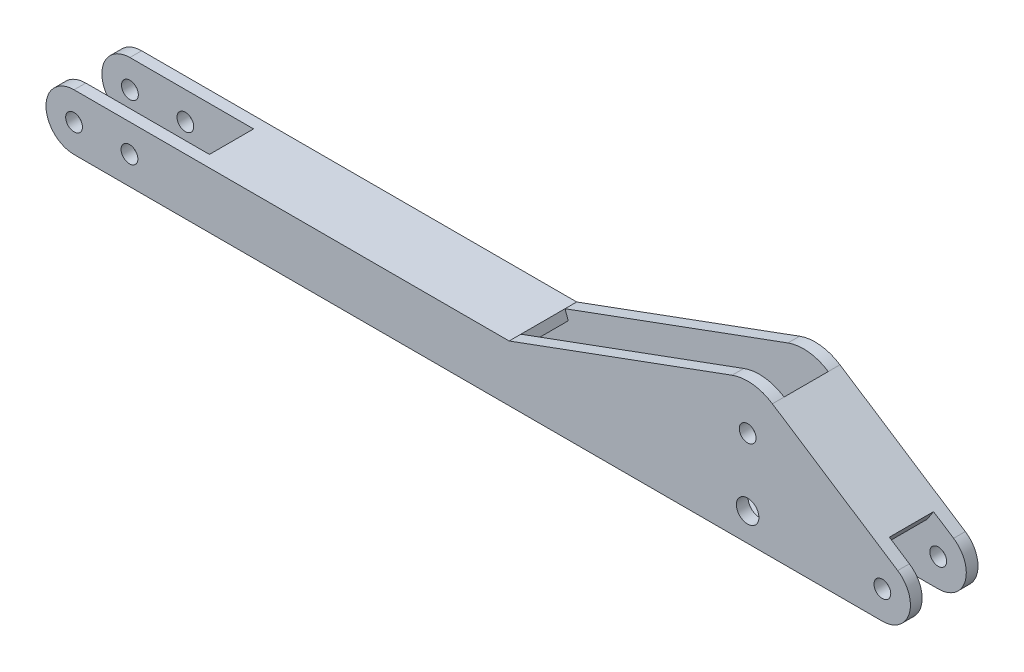
ISO-10303-21;
HEADER;
FILE_DESCRIPTION(('STEP AP214'),'2;1');
FILE_NAME('part.step','',(''),(''),'','','');
FILE_SCHEMA(('AUTOMOTIVE_DESIGN { 1 0 10303 214 1 1 1 1 }'));
ENDSEC;
DATA;
#1=APPLICATION_CONTEXT('core data for automotive mechanical design processes');
#2=APPLICATION_PROTOCOL_DEFINITION('international standard','automotive_design',2000,#1);
#3=PRODUCT_CONTEXT('',#1,'mechanical');
#4=PRODUCT('Part','Part','',(#3));
#5=PRODUCT_RELATED_PRODUCT_CATEGORY('part','',(#4));
#6=PRODUCT_DEFINITION_FORMATION('','',#4);
#7=PRODUCT_DEFINITION_CONTEXT('part definition',#1,'design');
#8=PRODUCT_DEFINITION('design','',#6,#7);
#9=PRODUCT_DEFINITION_SHAPE('','',#8);
#10=(LENGTH_UNIT() NAMED_UNIT(*) SI_UNIT(.MILLI.,.METRE.));
#11=(NAMED_UNIT(*) PLANE_ANGLE_UNIT() SI_UNIT($,.RADIAN.));
#12=(NAMED_UNIT(*) SI_UNIT($,.STERADIAN.) SOLID_ANGLE_UNIT());
#13=UNCERTAINTY_MEASURE_WITH_UNIT(LENGTH_MEASURE(1.E-05),#10,'distance_accuracy_value','');
#14=(GEOMETRIC_REPRESENTATION_CONTEXT(3) GLOBAL_UNCERTAINTY_ASSIGNED_CONTEXT((#13)) GLOBAL_UNIT_ASSIGNED_CONTEXT((#10,
#11,#12)) REPRESENTATION_CONTEXT('',''));
#15=CARTESIAN_POINT('',(0.,0.,0.));
#16=DIRECTION('',(0.,0.,1.));
#17=DIRECTION('',(1.,0.,0.));
#18=AXIS2_PLACEMENT_3D('',#15,#16,#17);
#19=CARTESIAN_POINT('',(3737.25460998602,-1090.59887645525,253.));
#20=DIRECTION('',(0.938772230359125,0.344538386114745,0.));
#21=DIRECTION('',(-0.344538386114745,0.938772230359126,0.));
#22=AXIS2_PLACEMENT_3D('',#19,#20,#21);
#23=PLANE('',#22);
#24=DIRECTION('',(-0.344538386114745,0.938772230359125,0.));
#25=VECTOR('',#24,1.);
#26=CARTESIAN_POINT('',(3737.25460998602,-1090.59887645525,253.));
#27=LINE('',#26,#25);
#28=CARTESIAN_POINT('',(3368.92422481028,-86.9999999999998,253.));
#29=VERTEX_POINT('',#28);
#30=CARTESIAN_POINT('',(3363.41747708127,-71.9956287719269,253.));
#31=VERTEX_POINT('',#30);
#32=EDGE_CURVE('E378',#29,#31,#27,.T.);
#33=ORIENTED_EDGE('',*,*,#32,.T.);
#34=DIRECTION('',(0.,0.,-1.));
#35=VECTOR('',#34,1.);
#36=CARTESIAN_POINT('',(3363.41747708127,-71.9956287719263,253.));
#37=LINE('',#36,#35);
#38=CARTESIAN_POINT('',(3363.41747708127,-71.9956287719261,53.));
#39=VERTEX_POINT('',#38);
#40=EDGE_CURVE('E11',#31,#39,#37,.T.);
#41=ORIENTED_EDGE('',*,*,#40,.T.);
#42=DIRECTION('',(-0.344538386114745,0.938772230359125,0.));
#43=VECTOR('',#42,1.);
#44=CARTESIAN_POINT('',(3737.25460998602,-1090.59887645525,53.));
#45=LINE('',#44,#43);
#46=CARTESIAN_POINT('',(3368.92422481028,-86.9999999999997,53.));
#47=VERTEX_POINT('',#46);
#48=EDGE_CURVE('E385',#47,#39,#45,.T.);
#49=ORIENTED_EDGE('',*,*,#48,.F.);
#50=DIRECTION('',(0.,0.,1.));
#51=VECTOR('',#50,1.);
#52=CARTESIAN_POINT('',(3368.92422481028,-86.9999999999997,253.));
#53=LINE('',#52,#51);
#54=EDGE_CURVE('E392',#47,#29,#53,.T.);
#55=ORIENTED_EDGE('',*,*,#54,.T.);
#56=EDGE_LOOP('',(#33,#41,#49,#55));
#57=FACE_BOUND('',#56,.T.);
#58=ADVANCED_FACE('F33',(#57),#23,.F.);
#59=CARTESIAN_POINT('',(3050.,305.,306.));
#60=DIRECTION('',(0.,0.,-1.));
#61=DIRECTION('',(-1.,0.,0.));
#62=AXIS2_PLACEMENT_3D('',#59,#60,#61);
#63=CYLINDRICAL_SURFACE('',#62,205.);
#64=DIRECTION('',(0.,0.,-1.));
#65=VECTOR('',#64,1.);
#66=CARTESIAN_POINT('',(2979.36963084648,497.448307223621,306.));
#67=LINE('',#66,#65);
#68=CARTESIAN_POINT('',(2979.36963084648,497.448307223621,53.));
#69=VERTEX_POINT('',#68);
#70=CARTESIAN_POINT('',(2979.36963084648,497.448307223621,0.));
#71=VERTEX_POINT('',#70);
#72=EDGE_CURVE('E350',#69,#71,#67,.T.);
#73=ORIENTED_EDGE('',*,*,#72,.F.);
#74=CARTESIAN_POINT('',(3050.,305.,53.));
#75=DIRECTION('',(0.,0.,-1.));
#76=DIRECTION('',(-1.,0.,0.));
#77=AXIS2_PLACEMENT_3D('',#74,#75,#76);
#78=CIRCLE('',#77,205.);
#79=CARTESIAN_POINT('',(3162.04770969218,476.669189876161,53.));
#80=VERTEX_POINT('',#79);
#81=EDGE_CURVE('E399',#69,#80,#78,.T.);
#82=ORIENTED_EDGE('',*,*,#81,.T.);
#83=DIRECTION('',(0.,0.,-1.));
#84=VECTOR('',#83,1.);
#85=CARTESIAN_POINT('',(3162.04770969218,476.669189876161,306.));
#86=LINE('',#85,#84);
#87=CARTESIAN_POINT('',(3162.04770969218,476.669189876161,0.));
#88=VERTEX_POINT('',#87);
#89=EDGE_CURVE('E309',#80,#88,#86,.T.);
#90=ORIENTED_EDGE('',*,*,#89,.T.);
#91=CARTESIAN_POINT('',(3050.,305.,0.));
#92=DIRECTION('',(0.,0.,1.));
#93=DIRECTION('',(1.,0.,0.));
#94=AXIS2_PLACEMENT_3D('',#91,#92,#93);
#95=CIRCLE('',#94,205.);
#96=EDGE_CURVE('E290',#88,#71,#95,.T.);
#97=ORIENTED_EDGE('',*,*,#96,.T.);
#98=EDGE_LOOP('',(#73,#82,#90,#97));
#99=FACE_BOUND('',#98,.T.);
#100=ADVANCED_FACE('F440',(#99),#63,.T.);
#101=CARTESIAN_POINT('',(1970.,127.,306.));
#102=DIRECTION('',(0.344538386114745,-0.938772230359125,0.));
#103=DIRECTION('',(0.938772230359126,0.344538386114745,0.));
#104=AXIS2_PLACEMENT_3D('',#101,#102,#103);
#105=PLANE('',#104);
#106=DIRECTION('',(0.,0.,-1.));
#107=VECTOR('',#106,1.);
#108=CARTESIAN_POINT('',(1970.,127.,306.));
#109=LINE('',#108,#107);
#110=CARTESIAN_POINT('',(1970.,127.,53.));
#111=VERTEX_POINT('',#110);
#112=CARTESIAN_POINT('',(1970.,127.,0.));
#113=VERTEX_POINT('',#112);
#114=EDGE_CURVE('E346',#111,#113,#109,.T.);
#115=ORIENTED_EDGE('',*,*,#114,.F.);
#116=DIRECTION('',(-0.938772230359125,-0.344538386114745,0.));
#117=VECTOR('',#116,1.);
#118=CARTESIAN_POINT('',(1970.,127.,53.));
#119=LINE('',#118,#117);
#120=EDGE_CURVE('E382',#69,#111,#119,.T.);
#121=ORIENTED_EDGE('',*,*,#120,.F.);
#122=ORIENTED_EDGE('',*,*,#72,.T.);
#123=DIRECTION('',(-0.938772230359125,-0.344538386114745,0.));
#124=VECTOR('',#123,1.);
#125=CARTESIAN_POINT('',(1970.,127.,0.));
#126=LINE('',#125,#124);
#127=EDGE_CURVE('E312',#71,#113,#126,.T.);
#128=ORIENTED_EDGE('',*,*,#127,.T.);
#129=EDGE_LOOP('',(#115,#121,#122,#128));
#130=FACE_BOUND('',#129,.T.);
#131=ADVANCED_FACE('F515',(#130),#105,.F.);
#132=CARTESIAN_POINT('',(3050.,305.,306.));
#133=DIRECTION('',(0.,0.,-1.));
#134=DIRECTION('',(-1.,0.,0.));
#135=AXIS2_PLACEMENT_3D('',#132,#133,#134);
#136=CYLINDRICAL_SURFACE('',#135,38.0000000000003);
#137=CARTESIAN_POINT('',(3050.,305.,53.));
#138=DIRECTION('',(0.,0.,-1.));
#139=DIRECTION('',(-1.,0.,0.));
#140=AXIS2_PLACEMENT_3D('',#137,#138,#139);
#141=CIRCLE('',#140,38.0000000000003);
#142=CARTESIAN_POINT('',(3012.,305.,53.));
#143=VERTEX_POINT('',#142);
#144=EDGE_CURVE('E396',#143,#143,#141,.T.);
#145=ORIENTED_EDGE('',*,*,#144,.F.);
#146=EDGE_LOOP('',(#145));
#147=FACE_BOUND('',#146,.T.);
#148=CARTESIAN_POINT('',(3050.,305.,0.));
#149=DIRECTION('',(0.,0.,1.));
#150=DIRECTION('',(1.,0.,0.));
#151=AXIS2_PLACEMENT_3D('',#148,#149,#150);
#152=CIRCLE('',#151,38.0000000000003);
#153=CARTESIAN_POINT('',(3088.,305.,0.));
#154=VERTEX_POINT('',#153);
#155=EDGE_CURVE('E266',#154,#154,#152,.T.);
#156=ORIENTED_EDGE('',*,*,#155,.F.);
#157=EDGE_LOOP('',(#156));
#158=FACE_BOUND('',#157,.T.);
#159=ADVANCED_FACE('F528',(#147,#158),#136,.F.);
#160=CARTESIAN_POINT('',(3050.,0.,306.));
#161=DIRECTION('',(0.,0.,-1.));
#162=DIRECTION('',(-1.,0.,0.));
#163=AXIS2_PLACEMENT_3D('',#160,#161,#162);
#164=CYLINDRICAL_SURFACE('',#163,51.0000000000001);
#165=CARTESIAN_POINT('',(3050.,0.,253.));
#166=DIRECTION('',(0.,0.,1.));
#167=DIRECTION('',(1.,0.,0.));
#168=AXIS2_PLACEMENT_3D('',#165,#166,#167);
#169=CIRCLE('',#168,51.0000000000001);
#170=CARTESIAN_POINT('',(3101.,0.,253.));
#171=VERTEX_POINT('',#170);
#172=EDGE_CURVE('E414',#171,#171,#169,.T.);
#173=ORIENTED_EDGE('',*,*,#172,.F.);
#174=EDGE_LOOP('',(#173));
#175=FACE_BOUND('',#174,.T.);
#176=CARTESIAN_POINT('',(3050.,0.,306.));
#177=DIRECTION('',(0.,0.,1.));
#178=DIRECTION('',(1.,0.,0.));
#179=AXIS2_PLACEMENT_3D('',#176,#177,#178);
#180=CIRCLE('',#179,51.0000000000001);
#181=CARTESIAN_POINT('',(3101.,0.,306.));
#182=VERTEX_POINT('',#181);
#183=EDGE_CURVE('E275',#182,#182,#180,.T.);
#184=ORIENTED_EDGE('',*,*,#183,.T.);
#185=EDGE_LOOP('',(#184));
#186=FACE_BOUND('',#185,.T.);
#187=ADVANCED_FACE('F569',(#175,#186),#164,.F.);
#188=CARTESIAN_POINT('',(3660.,-127.,306.));
#189=DIRECTION('',(0.,1.,0.));
#190=DIRECTION('',(-1.,0.,0.));
#191=AXIS2_PLACEMENT_3D('',#188,#189,#190);
#192=PLANE('',#191);
#193=DIRECTION('',(1.,0.,0.));
#194=VECTOR('',#193,1.);
#195=CARTESIAN_POINT('',(3447.69011303529,-127.,53.));
#196=LINE('',#195,#194);
#197=CARTESIAN_POINT('',(3447.69011303529,-127.,53.));
#198=VERTEX_POINT('',#197);
#199=CARTESIAN_POINT('',(3660.,-127.,53.));
#200=VERTEX_POINT('',#199);
#201=EDGE_CURVE('E210',#198,#200,#196,.T.);
#202=ORIENTED_EDGE('',*,*,#201,.F.);
#203=DIRECTION('',(0.,0.,1.));
#204=VECTOR('',#203,1.);
#205=CARTESIAN_POINT('',(3447.69011303529,-127.,53.));
#206=LINE('',#205,#204);
#207=CARTESIAN_POINT('',(3447.69011303529,-127.,253.));
#208=VERTEX_POINT('',#207);
#209=EDGE_CURVE('E229',#198,#208,#206,.T.);
#210=ORIENTED_EDGE('',*,*,#209,.T.);
#211=DIRECTION('',(1.,0.,0.));
#212=VECTOR('',#211,1.);
#213=CARTESIAN_POINT('',(3447.69011303529,-127.,253.));
#214=LINE('',#213,#212);
#215=CARTESIAN_POINT('',(3660.,-127.,253.));
#216=VERTEX_POINT('',#215);
#217=EDGE_CURVE('E226',#208,#216,#214,.T.);
#218=ORIENTED_EDGE('',*,*,#217,.T.);
#219=DIRECTION('',(0.,0.,-1.));
#220=VECTOR('',#219,1.);
#221=CARTESIAN_POINT('',(3660.,-127.,306.));
#222=LINE('',#221,#220);
#223=CARTESIAN_POINT('',(3660.,-127.,306.));
#224=VERTEX_POINT('',#223);
#225=EDGE_CURVE('E336',#224,#216,#222,.T.);
#226=ORIENTED_EDGE('',*,*,#225,.F.);
#227=DIRECTION('',(1.,0.,0.));
#228=VECTOR('',#227,1.);
#229=CARTESIAN_POINT('',(3660.,-127.,306.));
#230=LINE('',#229,#228);
#231=CARTESIAN_POINT('',(0.,-127.,306.));
#232=VERTEX_POINT('',#231);
#233=EDGE_CURVE('E303',#232,#224,#230,.T.);
#234=ORIENTED_EDGE('',*,*,#233,.F.);
#235=DIRECTION('',(0.,0.,-1.));
#236=VECTOR('',#235,1.);
#237=CARTESIAN_POINT('',(0.,-127.,306.));
#238=LINE('',#237,#236);
#239=CARTESIAN_POINT('',(0.,-127.,0.));
#240=VERTEX_POINT('',#239);
#241=EDGE_CURVE('E339',#232,#240,#238,.T.);
#242=ORIENTED_EDGE('',*,*,#241,.T.);
#243=DIRECTION('',(1.,0.,0.));
#244=VECTOR('',#243,1.);
#245=CARTESIAN_POINT('',(3660.,-127.,0.));
#246=LINE('',#245,#244);
#247=CARTESIAN_POINT('',(3660.,-127.,0.));
#248=VERTEX_POINT('',#247);
#249=EDGE_CURVE('E320',#240,#248,#246,.T.);
#250=ORIENTED_EDGE('',*,*,#249,.T.);
#251=EDGE_CURVE('E335',#200,#248,#222,.T.);
#252=ORIENTED_EDGE('',*,*,#251,.F.);
#253=EDGE_LOOP('',(#202,#210,#218,#226,#234,#242,#250,#252));
#254=FACE_BOUND('',#253,.T.);
#255=ADVANCED_FACE('F459',(#254),#192,.F.);
#256=CARTESIAN_POINT('',(3660.,0.,306.));
#257=DIRECTION('',(0.,0.,-1.));
#258=DIRECTION('',(-1.,0.,0.));
#259=AXIS2_PLACEMENT_3D('',#256,#257,#258);
#260=CYLINDRICAL_SURFACE('',#259,127.);
#261=CARTESIAN_POINT('',(3660.,0.,53.));
#262=DIRECTION('',(0.,0.,1.));
#263=DIRECTION('',(1.,0.,0.));
#264=AXIS2_PLACEMENT_3D('',#261,#262,#263);
#265=CIRCLE('',#264,127.);
#266=CARTESIAN_POINT('',(3729.41492258979,106.351156654987,53.));
#267=VERTEX_POINT('',#266);
#268=EDGE_CURVE('E214',#200,#267,#265,.T.);
#269=ORIENTED_EDGE('',*,*,#268,.F.);
#270=ORIENTED_EDGE('',*,*,#251,.T.);
#271=CARTESIAN_POINT('',(3660.,0.,0.));
#272=DIRECTION('',(0.,0.,1.));
#273=DIRECTION('',(1.,0.,0.));
#274=AXIS2_PLACEMENT_3D('',#271,#272,#273);
#275=CIRCLE('',#274,127.);
#276=CARTESIAN_POINT('',(3729.41492258979,106.351156654987,0.));
#277=VERTEX_POINT('',#276);
#278=EDGE_CURVE('E323',#248,#277,#275,.T.);
#279=ORIENTED_EDGE('',*,*,#278,.T.);
#280=DIRECTION('',(0.,0.,-1.));
#281=VECTOR('',#280,1.);
#282=CARTESIAN_POINT('',(3729.41492258979,106.351156654987,306.));
#283=LINE('',#282,#281);
#284=EDGE_CURVE('E331',#267,#277,#283,.T.);
#285=ORIENTED_EDGE('',*,*,#284,.F.);
#286=EDGE_LOOP('',(#269,#270,#279,#285));
#287=FACE_BOUND('',#286,.T.);
#288=ADVANCED_FACE('F429',(#287),#260,.T.);
#289=CARTESIAN_POINT('',(3162.04770969218,476.669189876161,306.));
#290=DIRECTION('',(-0.546574193620384,-0.837410682322734,0.));
#291=DIRECTION('',(0.837410682322734,-0.546574193620384,0.));
#292=AXIS2_PLACEMENT_3D('',#289,#290,#291);
#293=PLANE('',#292);
#294=ORIENTED_EDGE('',*,*,#89,.F.);
#295=DIRECTION('',(0.837410682322734,-0.546574193620384,0.));
#296=VECTOR('',#295,1.);
#297=CARTESIAN_POINT('',(3162.04770969218,476.669189876161,53.));
#298=LINE('',#297,#296);
#299=CARTESIAN_POINT('',(3162.05366929732,476.665300068634,53.));
#300=VERTEX_POINT('',#299);
#301=EDGE_CURVE('E401',#80,#300,#298,.T.);
#302=ORIENTED_EDGE('',*,*,#301,.T.);
#303=DIRECTION('',(0.,0.,1.));
#304=VECTOR('',#303,1.);
#305=CARTESIAN_POINT('',(3162.05366929732,476.665300068634,306.));
#306=LINE('',#305,#304);
#307=CARTESIAN_POINT('',(3162.05366929732,476.665300068635,253.));
#308=VERTEX_POINT('',#307);
#309=EDGE_CURVE('E364',#300,#308,#306,.T.);
#310=ORIENTED_EDGE('',*,*,#309,.T.);
#311=DIRECTION('',(-0.837410682322734,0.546574193620384,0.));
#312=VECTOR('',#311,1.);
#313=CARTESIAN_POINT('',(3162.04770969218,476.669189876161,253.));
#314=LINE('',#313,#312);
#315=CARTESIAN_POINT('',(3162.04770969218,476.669189876161,253.));
#316=VERTEX_POINT('',#315);
#317=EDGE_CURVE('E377',#308,#316,#314,.T.);
#318=ORIENTED_EDGE('',*,*,#317,.T.);
#319=CARTESIAN_POINT('',(3162.04770969218,476.669189876161,306.));
#320=VERTEX_POINT('',#319);
#321=EDGE_CURVE('E328',#320,#316,#86,.T.);
#322=ORIENTED_EDGE('',*,*,#321,.F.);
#323=DIRECTION('',(-0.837410682322734,0.546574193620384,0.));
#324=VECTOR('',#323,1.);
#325=CARTESIAN_POINT('',(3162.04770969218,476.669189876161,306.));
#326=LINE('',#325,#324);
#327=CARTESIAN_POINT('',(3729.41492258979,106.351156654987,306.));
#328=VERTEX_POINT('',#327);
#329=EDGE_CURVE('E307',#328,#320,#326,.T.);
#330=ORIENTED_EDGE('',*,*,#329,.F.);
#331=CARTESIAN_POINT('',(3729.41492258979,106.351156654987,253.));
#332=VERTEX_POINT('',#331);
#333=EDGE_CURVE('E332',#328,#332,#283,.T.);
#334=ORIENTED_EDGE('',*,*,#333,.T.);
#335=DIRECTION('',(-0.837410682322734,0.546574193620384,0.));
#336=VECTOR('',#335,1.);
#337=CARTESIAN_POINT('',(3729.41492258979,106.351156654987,253.));
#338=LINE('',#337,#336);
#339=CARTESIAN_POINT('',(3638.66,165.586487274375,253.));
#340=VERTEX_POINT('',#339);
#341=EDGE_CURVE('E221',#332,#340,#338,.T.);
#342=ORIENTED_EDGE('',*,*,#341,.T.);
#343=DIRECTION('',(0.,0.,1.));
#344=VECTOR('',#343,1.);
#345=CARTESIAN_POINT('',(3638.66,165.586487274375,53.));
#346=LINE('',#345,#344);
#347=CARTESIAN_POINT('',(3638.66,165.586487274375,53.));
#348=VERTEX_POINT('',#347);
#349=EDGE_CURVE('E212',#348,#340,#346,.T.);
#350=ORIENTED_EDGE('',*,*,#349,.F.);
#351=DIRECTION('',(-0.837410682322734,0.546574193620384,0.));
#352=VECTOR('',#351,1.);
#353=CARTESIAN_POINT('',(3729.41492258979,106.351156654987,53.));
#354=LINE('',#353,#352);
#355=EDGE_CURVE('E208',#267,#348,#354,.T.);
#356=ORIENTED_EDGE('',*,*,#355,.F.);
#357=ORIENTED_EDGE('',*,*,#284,.T.);
#358=DIRECTION('',(-0.837410682322734,0.546574193620384,0.));
#359=VECTOR('',#358,1.);
#360=CARTESIAN_POINT('',(3162.04770969218,476.669189876161,0.));
#361=LINE('',#360,#359);
#362=EDGE_CURVE('E297',#277,#88,#361,.T.);
#363=ORIENTED_EDGE('',*,*,#362,.T.);
#364=EDGE_LOOP('',(#294,#302,#310,#318,#322,#330,#334,#342,#350,#356,#357,#363));
#365=FACE_BOUND('',#364,.T.);
#366=ADVANCED_FACE('F428',(#365),#293,.F.);
#367=CARTESIAN_POINT('',(3660.,0.,306.));
#368=DIRECTION('',(0.,0.,-1.));
#369=DIRECTION('',(-1.,0.,0.));
#370=AXIS2_PLACEMENT_3D('',#367,#368,#369);
#371=CYLINDRICAL_SURFACE('',#370,37.9999999999998);
#372=CARTESIAN_POINT('',(3660.,0.,0.));
#373=DIRECTION('',(0.,0.,1.));
#374=DIRECTION('',(1.,0.,0.));
#375=AXIS2_PLACEMENT_3D('',#372,#373,#374);
#376=CIRCLE('',#375,37.9999999999998);
#377=CARTESIAN_POINT('',(3698.,0.,0.));
#378=VERTEX_POINT('',#377);
#379=EDGE_CURVE('E278',#378,#378,#376,.T.);
#380=ORIENTED_EDGE('',*,*,#379,.F.);
#381=EDGE_LOOP('',(#380));
#382=FACE_BOUND('',#381,.T.);
#383=CARTESIAN_POINT('',(3660.,0.,53.));
#384=DIRECTION('',(0.,0.,1.));
#385=DIRECTION('',(1.,0.,0.));
#386=AXIS2_PLACEMENT_3D('',#383,#384,#385);
#387=CIRCLE('',#386,37.9999999999998);
#388=CARTESIAN_POINT('',(3698.,0.,53.));
#389=VERTEX_POINT('',#388);
#390=EDGE_CURVE('E222',#389,#389,#387,.T.);
#391=ORIENTED_EDGE('',*,*,#390,.T.);
#392=EDGE_LOOP('',(#391));
#393=FACE_BOUND('',#392,.T.);
#394=ADVANCED_FACE('F574',(#382,#393),#371,.F.);
#395=CARTESIAN_POINT('',(0.,0.,306.));
#396=DIRECTION('',(0.,0.,-1.));
#397=DIRECTION('',(-1.,0.,0.));
#398=AXIS2_PLACEMENT_3D('',#395,#396,#397);
#399=CYLINDRICAL_SURFACE('',#398,38.);
#400=CARTESIAN_POINT('',(0.,0.,53.));
#401=DIRECTION('',(0.,0.,-1.));
#402=DIRECTION('',(-1.,0.,0.));
#403=AXIS2_PLACEMENT_3D('',#400,#401,#402);
#404=CIRCLE('',#403,38.);
#405=CARTESIAN_POINT('',(-38.,0.,53.));
#406=VERTEX_POINT('',#405);
#407=EDGE_CURVE('E257',#406,#406,#404,.T.);
#408=ORIENTED_EDGE('',*,*,#407,.F.);
#409=EDGE_LOOP('',(#408));
#410=FACE_BOUND('',#409,.T.);
#411=CARTESIAN_POINT('',(0.,0.,0.));
#412=DIRECTION('',(0.,0.,1.));
#413=DIRECTION('',(1.,0.,0.));
#414=AXIS2_PLACEMENT_3D('',#411,#412,#413);
#415=CIRCLE('',#414,38.);
#416=CARTESIAN_POINT('',(38.,0.,0.));
#417=VERTEX_POINT('',#416);
#418=EDGE_CURVE('E284',#417,#417,#415,.T.);
#419=ORIENTED_EDGE('',*,*,#418,.F.);
#420=EDGE_LOOP('',(#419));
#421=FACE_BOUND('',#420,.T.);
#422=ADVANCED_FACE('F578',(#410,#421),#399,.F.);
#423=CARTESIAN_POINT('',(251.,0.,306.));
#424=DIRECTION('',(0.,0.,-1.));
#425=DIRECTION('',(-1.,0.,0.));
#426=AXIS2_PLACEMENT_3D('',#423,#424,#425);
#427=CYLINDRICAL_SURFACE('',#426,38.);
#428=CARTESIAN_POINT('',(251.,0.,53.));
#429=DIRECTION('',(0.,0.,-1.));
#430=DIRECTION('',(-1.,0.,0.));
#431=AXIS2_PLACEMENT_3D('',#428,#429,#430);
#432=CIRCLE('',#431,38.);
#433=CARTESIAN_POINT('',(213.,0.,53.));
#434=VERTEX_POINT('',#433);
#435=EDGE_CURVE('E256',#434,#434,#432,.T.);
#436=ORIENTED_EDGE('',*,*,#435,.F.);
#437=EDGE_LOOP('',(#436));
#438=FACE_BOUND('',#437,.T.);
#439=CARTESIAN_POINT('',(251.,0.,0.));
#440=DIRECTION('',(0.,0.,1.));
#441=DIRECTION('',(1.,0.,0.));
#442=AXIS2_PLACEMENT_3D('',#439,#440,#441);
#443=CIRCLE('',#442,38.);
#444=CARTESIAN_POINT('',(289.,0.,0.));
#445=VERTEX_POINT('',#444);
#446=EDGE_CURVE('E262',#445,#445,#443,.T.);
#447=ORIENTED_EDGE('',*,*,#446,.F.);
#448=EDGE_LOOP('',(#447));
#449=FACE_BOUND('',#448,.T.);
#450=ADVANCED_FACE('F560',(#438,#449),#427,.F.);
#451=CARTESIAN_POINT('',(3050.,305.,306.));
#452=DIRECTION('',(0.,0.,1.));
#453=DIRECTION('',(1.,0.,0.));
#454=AXIS2_PLACEMENT_3D('',#451,#452,#453);
#455=PLANE('',#454);
#456=CARTESIAN_POINT('',(3050.,305.,306.));
#457=DIRECTION('',(0.,0.,1.));
#458=DIRECTION('',(1.,0.,0.));
#459=AXIS2_PLACEMENT_3D('',#456,#457,#458);
#460=CIRCLE('',#459,38.0000000000003);
#461=CARTESIAN_POINT('',(3088.,305.,306.));
#462=VERTEX_POINT('',#461);
#463=EDGE_CURVE('E269',#462,#462,#460,.T.);
#464=ORIENTED_EDGE('',*,*,#463,.F.);
#465=EDGE_LOOP('',(#464));
#466=FACE_BOUND('',#465,.T.);
#467=CARTESIAN_POINT('',(3660.,0.,306.));
#468=DIRECTION('',(0.,0.,1.));
#469=DIRECTION('',(1.,0.,0.));
#470=AXIS2_PLACEMENT_3D('',#467,#468,#469);
#471=CIRCLE('',#470,37.9999999999998);
#472=CARTESIAN_POINT('',(3698.,0.,306.));
#473=VERTEX_POINT('',#472);
#474=EDGE_CURVE('E281',#473,#473,#471,.T.);
#475=ORIENTED_EDGE('',*,*,#474,.F.);
#476=EDGE_LOOP('',(#475));
#477=FACE_BOUND('',#476,.T.);
#478=CARTESIAN_POINT('',(3050.,305.,306.));
#479=DIRECTION('',(0.,0.,1.));
#480=DIRECTION('',(1.,0.,0.));
#481=AXIS2_PLACEMENT_3D('',#478,#479,#480);
#482=CIRCLE('',#481,205.);
#483=CARTESIAN_POINT('',(2979.36963084648,497.448307223621,306.));
#484=VERTEX_POINT('',#483);
#485=EDGE_CURVE('E293',#320,#484,#482,.T.);
#486=ORIENTED_EDGE('',*,*,#485,.T.);
#487=DIRECTION('',(-0.938772230359125,-0.344538386114745,0.));
#488=VECTOR('',#487,1.);
#489=CARTESIAN_POINT('',(1970.,127.,306.));
#490=LINE('',#489,#488);
#491=CARTESIAN_POINT('',(1970.,127.,306.));
#492=VERTEX_POINT('',#491);
#493=EDGE_CURVE('E296',#484,#492,#490,.T.);
#494=ORIENTED_EDGE('',*,*,#493,.T.);
#495=DIRECTION('',(-1.,0.,0.));
#496=VECTOR('',#495,1.);
#497=CARTESIAN_POINT('',(0.,127.,306.));
#498=LINE('',#497,#496);
#499=CARTESIAN_POINT('',(0.,127.,306.));
#500=VERTEX_POINT('',#499);
#501=EDGE_CURVE('E299',#492,#500,#498,.T.);
#502=ORIENTED_EDGE('',*,*,#501,.T.);
#503=CARTESIAN_POINT('',(0.,0.,306.));
#504=DIRECTION('',(0.,0.,1.));
#505=DIRECTION('',(1.,0.,0.));
#506=AXIS2_PLACEMENT_3D('',#503,#504,#505);
#507=CIRCLE('',#506,127.);
#508=EDGE_CURVE('E301',#500,#232,#507,.T.);
#509=ORIENTED_EDGE('',*,*,#508,.T.);
#510=ORIENTED_EDGE('',*,*,#233,.T.);
#511=CARTESIAN_POINT('',(3660.,0.,306.));
#512=DIRECTION('',(0.,0.,1.));
#513=DIRECTION('',(1.,0.,0.));
#514=AXIS2_PLACEMENT_3D('',#511,#512,#513);
#515=CIRCLE('',#514,127.);
#516=EDGE_CURVE('E305',#224,#328,#515,.T.);
#517=ORIENTED_EDGE('',*,*,#516,.T.);
#518=ORIENTED_EDGE('',*,*,#329,.T.);
#519=EDGE_LOOP('',(#486,#494,#502,#509,#510,#517,#518));
#520=FACE_BOUND('',#519,.T.);
#521=CARTESIAN_POINT('',(0.,0.,306.));
#522=DIRECTION('',(0.,0.,1.));
#523=DIRECTION('',(1.,0.,0.));
#524=AXIS2_PLACEMENT_3D('',#521,#522,#523);
#525=CIRCLE('',#524,38.);
#526=CARTESIAN_POINT('',(38.,0.,306.));
#527=VERTEX_POINT('',#526);
#528=EDGE_CURVE('E287',#527,#527,#525,.T.);
#529=ORIENTED_EDGE('',*,*,#528,.F.);
#530=EDGE_LOOP('',(#529));
#531=FACE_BOUND('',#530,.T.);
#532=ORIENTED_EDGE('',*,*,#183,.F.);
#533=EDGE_LOOP('',(#532));
#534=FACE_BOUND('',#533,.T.);
#535=CARTESIAN_POINT('',(251.,0.,306.));
#536=DIRECTION('',(0.,0.,1.));
#537=DIRECTION('',(1.,0.,0.));
#538=AXIS2_PLACEMENT_3D('',#535,#536,#537);
#539=CIRCLE('',#538,38.);
#540=CARTESIAN_POINT('',(289.,0.,306.));
#541=VERTEX_POINT('',#540);
#542=EDGE_CURVE('E263',#541,#541,#539,.T.);
#543=ORIENTED_EDGE('',*,*,#542,.F.);
#544=EDGE_LOOP('',(#543));
#545=FACE_BOUND('',#544,.T.);
#546=ADVANCED_FACE('F448',(#466,#477,#520,#531,#534,#545),#455,.T.);
#547=CARTESIAN_POINT('',(3050.,305.,0.));
#548=DIRECTION('',(0.,0.,1.));
#549=DIRECTION('',(1.,0.,0.));
#550=AXIS2_PLACEMENT_3D('',#547,#548,#549);
#551=PLANE('',#550);
#552=ORIENTED_EDGE('',*,*,#96,.F.);
#553=ORIENTED_EDGE('',*,*,#362,.F.);
#554=ORIENTED_EDGE('',*,*,#278,.F.);
#555=ORIENTED_EDGE('',*,*,#249,.F.);
#556=CARTESIAN_POINT('',(0.,0.,0.));
#557=DIRECTION('',(0.,0.,1.));
#558=DIRECTION('',(1.,0.,0.));
#559=AXIS2_PLACEMENT_3D('',#556,#557,#558);
#560=CIRCLE('',#559,127.);
#561=CARTESIAN_POINT('',(0.,127.,0.));
#562=VERTEX_POINT('',#561);
#563=EDGE_CURVE('E318',#562,#240,#560,.T.);
#564=ORIENTED_EDGE('',*,*,#563,.F.);
#565=DIRECTION('',(-1.,0.,0.));
#566=VECTOR('',#565,1.);
#567=CARTESIAN_POINT('',(0.,127.,0.));
#568=LINE('',#567,#566);
#569=EDGE_CURVE('E315',#113,#562,#568,.T.);
#570=ORIENTED_EDGE('',*,*,#569,.F.);
#571=ORIENTED_EDGE('',*,*,#127,.F.);
#572=EDGE_LOOP('',(#552,#553,#554,#555,#564,#570,#571));
#573=FACE_BOUND('',#572,.T.);
#574=ORIENTED_EDGE('',*,*,#418,.T.);
#575=EDGE_LOOP('',(#574));
#576=FACE_BOUND('',#575,.T.);
#577=ORIENTED_EDGE('',*,*,#379,.T.);
#578=EDGE_LOOP('',(#577));
#579=FACE_BOUND('',#578,.T.);
#580=CARTESIAN_POINT('',(3050.,0.,0.));
#581=DIRECTION('',(0.,0.,1.));
#582=DIRECTION('',(1.,0.,0.));
#583=AXIS2_PLACEMENT_3D('',#580,#581,#582);
#584=CIRCLE('',#583,51.0000000000001);
#585=CARTESIAN_POINT('',(3101.,0.,0.));
#586=VERTEX_POINT('',#585);
#587=EDGE_CURVE('E272',#586,#586,#584,.T.);
#588=ORIENTED_EDGE('',*,*,#587,.T.);
#589=EDGE_LOOP('',(#588));
#590=FACE_BOUND('',#589,.T.);
#591=ORIENTED_EDGE('',*,*,#155,.T.);
#592=EDGE_LOOP('',(#591));
#593=FACE_BOUND('',#592,.T.);
#594=ORIENTED_EDGE('',*,*,#446,.T.);
#595=EDGE_LOOP('',(#594));
#596=FACE_BOUND('',#595,.T.);
#597=ADVANCED_FACE('F435',(#573,#576,#579,#590,#593,#596),#551,.F.);
#598=ORIENTED_EDGE('',*,*,#321,.T.);
#599=CARTESIAN_POINT('',(3050.,305.,253.));
#600=DIRECTION('',(0.,0.,1.));
#601=DIRECTION('',(1.,0.,0.));
#602=AXIS2_PLACEMENT_3D('',#599,#600,#601);
#603=CIRCLE('',#602,205.);
#604=CARTESIAN_POINT('',(2979.36963084648,497.448307223621,253.));
#605=VERTEX_POINT('',#604);
#606=EDGE_CURVE('E391',#316,#605,#603,.T.);
#607=ORIENTED_EDGE('',*,*,#606,.T.);
#608=EDGE_CURVE('E351',#484,#605,#67,.T.);
#609=ORIENTED_EDGE('',*,*,#608,.F.);
#610=ORIENTED_EDGE('',*,*,#485,.F.);
#611=EDGE_LOOP('',(#598,#607,#609,#610));
#612=FACE_BOUND('',#611,.T.);
#613=ADVANCED_FACE('F35',(#612),#63,.T.);
#614=ORIENTED_EDGE('',*,*,#608,.T.);
#615=DIRECTION('',(0.938772230359125,0.344538386114745,0.));
#616=VECTOR('',#615,1.);
#617=CARTESIAN_POINT('',(1970.,127.,253.));
#618=LINE('',#617,#616);
#619=CARTESIAN_POINT('',(1970.,127.,253.));
#620=VERTEX_POINT('',#619);
#621=EDGE_CURVE('E477',#620,#605,#618,.T.);
#622=ORIENTED_EDGE('',*,*,#621,.F.);
#623=EDGE_CURVE('E347',#492,#620,#109,.T.);
#624=ORIENTED_EDGE('',*,*,#623,.F.);
#625=ORIENTED_EDGE('',*,*,#493,.F.);
#626=EDGE_LOOP('',(#614,#622,#624,#625));
#627=FACE_BOUND('',#626,.T.);
#628=ADVANCED_FACE('F520',(#627),#105,.F.);
#629=CARTESIAN_POINT('',(0.,127.,306.));
#630=DIRECTION('',(0.,-1.,0.));
#631=DIRECTION('',(1.,0.,0.));
#632=AXIS2_PLACEMENT_3D('',#629,#630,#631);
#633=PLANE('',#632);
#634=DIRECTION('',(0.,0.,-1.));
#635=VECTOR('',#634,1.);
#636=CARTESIAN_POINT('',(0.,127.,306.));
#637=LINE('',#636,#635);
#638=CARTESIAN_POINT('',(0.,127.,53.));
#639=VERTEX_POINT('',#638);
#640=EDGE_CURVE('E342',#639,#562,#637,.T.);
#641=ORIENTED_EDGE('',*,*,#640,.F.);
#642=DIRECTION('',(-1.,0.,0.));
#643=VECTOR('',#642,1.);
#644=CARTESIAN_POINT('',(-127.,127.,53.));
#645=LINE('',#644,#643);
#646=CARTESIAN_POINT('',(560.,127.,53.));
#647=VERTEX_POINT('',#646);
#648=EDGE_CURVE('E237',#647,#639,#645,.T.);
#649=ORIENTED_EDGE('',*,*,#648,.F.);
#650=DIRECTION('',(0.,0.,-1.));
#651=VECTOR('',#650,1.);
#652=CARTESIAN_POINT('',(560.,127.,53.));
#653=LINE('',#652,#651);
#654=CARTESIAN_POINT('',(560.,127.,253.));
#655=VERTEX_POINT('',#654);
#656=EDGE_CURVE('E242',#655,#647,#653,.T.);
#657=ORIENTED_EDGE('',*,*,#656,.F.);
#658=DIRECTION('',(1.,0.,0.));
#659=VECTOR('',#658,1.);
#660=CARTESIAN_POINT('',(-127.,127.,253.));
#661=LINE('',#660,#659);
#662=CARTESIAN_POINT('',(0.,127.,253.));
#663=VERTEX_POINT('',#662);
#664=EDGE_CURVE('E232',#663,#655,#661,.T.);
#665=ORIENTED_EDGE('',*,*,#664,.F.);
#666=EDGE_CURVE('E343',#500,#663,#637,.T.);
#667=ORIENTED_EDGE('',*,*,#666,.F.);
#668=ORIENTED_EDGE('',*,*,#501,.F.);
#669=ORIENTED_EDGE('',*,*,#623,.T.);
#670=DIRECTION('',(0.,0.,1.));
#671=VECTOR('',#670,1.);
#672=CARTESIAN_POINT('',(1970.,127.,253.));
#673=LINE('',#672,#671);
#674=EDGE_CURVE('E468',#111,#620,#673,.T.);
#675=ORIENTED_EDGE('',*,*,#674,.F.);
#676=ORIENTED_EDGE('',*,*,#114,.T.);
#677=ORIENTED_EDGE('',*,*,#569,.T.);
#678=EDGE_LOOP('',(#641,#649,#657,#665,#667,#668,#669,#675,#676,#677));
#679=FACE_BOUND('',#678,.T.);
#680=ADVANCED_FACE('F501',(#679),#633,.F.);
#681=CARTESIAN_POINT('',(0.,0.,306.));
#682=DIRECTION('',(0.,0.,-1.));
#683=DIRECTION('',(-1.,0.,0.));
#684=AXIS2_PLACEMENT_3D('',#681,#682,#683);
#685=CYLINDRICAL_SURFACE('',#684,127.);
#686=CARTESIAN_POINT('',(0.,0.,53.));
#687=DIRECTION('',(0.,0.,-1.));
#688=DIRECTION('',(-1.,0.,0.));
#689=AXIS2_PLACEMENT_3D('',#686,#687,#688);
#690=CIRCLE('',#689,127.);
#691=CARTESIAN_POINT('',(-92.520268049763,-87.,52.9999999999999));
#692=VERTEX_POINT('',#691);
#693=EDGE_CURVE('E260',#692,#639,#690,.T.);
#694=ORIENTED_EDGE('',*,*,#693,.T.);
#695=ORIENTED_EDGE('',*,*,#640,.T.);
#696=ORIENTED_EDGE('',*,*,#563,.T.);
#697=ORIENTED_EDGE('',*,*,#241,.F.);
#698=ORIENTED_EDGE('',*,*,#508,.F.);
#699=ORIENTED_EDGE('',*,*,#666,.T.);
#700=CARTESIAN_POINT('',(0.,0.,253.));
#701=DIRECTION('',(0.,0.,1.));
#702=DIRECTION('',(1.,0.,0.));
#703=AXIS2_PLACEMENT_3D('',#700,#701,#702);
#704=CIRCLE('',#703,127.);
#705=CARTESIAN_POINT('',(-92.520268049763,-87.,253.));
#706=VERTEX_POINT('',#705);
#707=EDGE_CURVE('E254',#663,#706,#704,.T.);
#708=ORIENTED_EDGE('',*,*,#707,.T.);
#709=DIRECTION('',(0.,0.,-1.));
#710=VECTOR('',#709,1.);
#711=CARTESIAN_POINT('',(-92.520268049763,-87.,306.));
#712=LINE('',#711,#710);
#713=EDGE_CURVE('E354',#692,#706,#712,.F.);
#714=ORIENTED_EDGE('',*,*,#713,.F.);
#715=EDGE_LOOP('',(#694,#695,#696,#697,#698,#699,#708,#714));
#716=FACE_BOUND('',#715,.T.);
#717=ADVANCED_FACE('F494',(#716),#685,.T.);
#718=ORIENTED_EDGE('',*,*,#225,.T.);
#719=CARTESIAN_POINT('',(3660.,0.,253.));
#720=DIRECTION('',(0.,0.,1.));
#721=DIRECTION('',(1.,0.,0.));
#722=AXIS2_PLACEMENT_3D('',#719,#720,#721);
#723=CIRCLE('',#722,127.);
#724=EDGE_CURVE('E218',#216,#332,#723,.T.);
#725=ORIENTED_EDGE('',*,*,#724,.T.);
#726=ORIENTED_EDGE('',*,*,#333,.F.);
#727=ORIENTED_EDGE('',*,*,#516,.F.);
#728=EDGE_LOOP('',(#718,#725,#726,#727));
#729=FACE_BOUND('',#728,.T.);
#730=ADVANCED_FACE('F454',(#729),#260,.T.);
#731=CARTESIAN_POINT('',(0.,0.,253.));
#732=DIRECTION('',(0.,0.,1.));
#733=DIRECTION('',(1.,0.,0.));
#734=AXIS2_PLACEMENT_3D('',#731,#732,#733);
#735=CIRCLE('',#734,38.);
#736=CARTESIAN_POINT('',(38.,0.,253.));
#737=VERTEX_POINT('',#736);
#738=EDGE_CURVE('E251',#737,#737,#735,.T.);
#739=ORIENTED_EDGE('',*,*,#738,.F.);
#740=EDGE_LOOP('',(#739));
#741=FACE_BOUND('',#740,.T.);
#742=ORIENTED_EDGE('',*,*,#528,.T.);
#743=EDGE_LOOP('',(#742));
#744=FACE_BOUND('',#743,.T.);
#745=ADVANCED_FACE('F572',(#741,#744),#399,.F.);
#746=CARTESIAN_POINT('',(3660.,0.,253.));
#747=DIRECTION('',(0.,0.,1.));
#748=DIRECTION('',(1.,0.,0.));
#749=AXIS2_PLACEMENT_3D('',#746,#747,#748);
#750=CIRCLE('',#749,37.9999999999998);
#751=CARTESIAN_POINT('',(3698.,0.,253.));
#752=VERTEX_POINT('',#751);
#753=EDGE_CURVE('E417',#752,#752,#750,.T.);
#754=ORIENTED_EDGE('',*,*,#753,.F.);
#755=EDGE_LOOP('',(#754));
#756=FACE_BOUND('',#755,.T.);
#757=ORIENTED_EDGE('',*,*,#474,.T.);
#758=EDGE_LOOP('',(#757));
#759=FACE_BOUND('',#758,.T.);
#760=ADVANCED_FACE('F567',(#756,#759),#371,.F.);
#761=CARTESIAN_POINT('',(3050.,0.,53.));
#762=DIRECTION('',(0.,0.,-1.));
#763=DIRECTION('',(-1.,0.,0.));
#764=AXIS2_PLACEMENT_3D('',#761,#762,#763);
#765=CIRCLE('',#764,51.0000000000001);
#766=CARTESIAN_POINT('',(2999.,0.,53.));
#767=VERTEX_POINT('',#766);
#768=EDGE_CURVE('E410',#767,#767,#765,.T.);
#769=ORIENTED_EDGE('',*,*,#768,.F.);
#770=EDGE_LOOP('',(#769));
#771=FACE_BOUND('',#770,.T.);
#772=ORIENTED_EDGE('',*,*,#587,.F.);
#773=EDGE_LOOP('',(#772));
#774=FACE_BOUND('',#773,.T.);
#775=ADVANCED_FACE('F563',(#771,#774),#164,.F.);
#776=CARTESIAN_POINT('',(3050.,305.,253.));
#777=DIRECTION('',(0.,0.,1.));
#778=DIRECTION('',(1.,0.,0.));
#779=AXIS2_PLACEMENT_3D('',#776,#777,#778);
#780=CIRCLE('',#779,38.0000000000003);
#781=CARTESIAN_POINT('',(3088.,305.,253.));
#782=VERTEX_POINT('',#781);
#783=EDGE_CURVE('E388',#782,#782,#780,.T.);
#784=ORIENTED_EDGE('',*,*,#783,.F.);
#785=EDGE_LOOP('',(#784));
#786=FACE_BOUND('',#785,.T.);
#787=ORIENTED_EDGE('',*,*,#463,.T.);
#788=EDGE_LOOP('',(#787));
#789=FACE_BOUND('',#788,.T.);
#790=ADVANCED_FACE('F558',(#786,#789),#136,.F.);
#791=CARTESIAN_POINT('',(251.,0.,253.));
#792=DIRECTION('',(0.,0.,1.));
#793=DIRECTION('',(1.,0.,0.));
#794=AXIS2_PLACEMENT_3D('',#791,#792,#793);
#795=CIRCLE('',#794,38.);
#796=CARTESIAN_POINT('',(289.,0.,253.));
#797=VERTEX_POINT('',#796);
#798=EDGE_CURVE('E249',#797,#797,#795,.T.);
#799=ORIENTED_EDGE('',*,*,#798,.F.);
#800=EDGE_LOOP('',(#799));
#801=FACE_BOUND('',#800,.T.);
#802=ORIENTED_EDGE('',*,*,#542,.T.);
#803=EDGE_LOOP('',(#802));
#804=FACE_BOUND('',#803,.T.);
#805=ADVANCED_FACE('F549',(#801,#804),#427,.F.);
#806=CARTESIAN_POINT('',(0.,-87.,0.));
#807=DIRECTION('',(0.,1.,0.));
#808=DIRECTION('',(-1.,0.,0.));
#809=AXIS2_PLACEMENT_3D('',#806,#807,#808);
#810=PLANE('',#809);
#811=DIRECTION('',(1.,0.,0.));
#812=VECTOR('',#811,1.);
#813=CARTESIAN_POINT('',(-127.,-87.,253.));
#814=LINE('',#813,#812);
#815=EDGE_CURVE('E234',#706,#29,#814,.T.);
#816=ORIENTED_EDGE('',*,*,#815,.T.);
#817=ORIENTED_EDGE('',*,*,#54,.F.);
#818=DIRECTION('',(-1.,0.,0.));
#819=VECTOR('',#818,1.);
#820=CARTESIAN_POINT('',(-127.,-87.,53.));
#821=LINE('',#820,#819);
#822=EDGE_CURVE('E236',#47,#692,#821,.T.);
#823=ORIENTED_EDGE('',*,*,#822,.T.);
#824=ORIENTED_EDGE('',*,*,#713,.T.);
#825=EDGE_LOOP('',(#816,#817,#823,#824));
#826=FACE_BOUND('',#825,.T.);
#827=ADVANCED_FACE('F491',(#826),#810,.T.);
#828=CARTESIAN_POINT('',(-127.,-87.,53.));
#829=DIRECTION('',(0.,0.,-1.));
#830=DIRECTION('',(-1.,0.,0.));
#831=AXIS2_PLACEMENT_3D('',#828,#829,#830);
#832=PLANE('',#831);
#833=ORIENTED_EDGE('',*,*,#301,.F.);
#834=ORIENTED_EDGE('',*,*,#81,.F.);
#835=ORIENTED_EDGE('',*,*,#120,.T.);
#836=DIRECTION('',(-0.344538386114745,0.938772230359125,0.));
#837=VECTOR('',#836,1.);
#838=CARTESIAN_POINT('',(2573.60887956667,-1517.66798757992,53.));
#839=LINE('',#838,#837);
#840=CARTESIAN_POINT('',(1984.68038252401,87.,53.));
#841=VERTEX_POINT('',#840);
#842=EDGE_CURVE('E474',#841,#111,#839,.T.);
#843=ORIENTED_EDGE('',*,*,#842,.F.);
#844=DIRECTION('',(-1.,0.,0.));
#845=VECTOR('',#844,1.);
#846=CARTESIAN_POINT('',(3250.,87.0000000000002,53.));
#847=LINE('',#846,#845);
#848=CARTESIAN_POINT('',(560.,87.,53.));
#849=VERTEX_POINT('',#848);
#850=EDGE_CURVE('E408',#841,#849,#847,.T.);
#851=ORIENTED_EDGE('',*,*,#850,.T.);
#852=DIRECTION('',(0.,1.,0.));
#853=VECTOR('',#852,1.);
#854=CARTESIAN_POINT('',(560.,-87.,53.));
#855=LINE('',#854,#853);
#856=EDGE_CURVE('E247',#849,#647,#855,.T.);
#857=ORIENTED_EDGE('',*,*,#856,.T.);
#858=ORIENTED_EDGE('',*,*,#648,.T.);
#859=ORIENTED_EDGE('',*,*,#693,.F.);
#860=ORIENTED_EDGE('',*,*,#822,.F.);
#861=ORIENTED_EDGE('',*,*,#48,.T.);
#862=DIRECTION('',(0.837410682322734,-0.546574193620384,0.));
#863=VECTOR('',#862,1.);
#864=CARTESIAN_POINT('',(1195.05537758714,1343.28458083883,53.));
#865=LINE('',#864,#863);
#866=EDGE_CURVE('E464',#39,#198,#865,.T.);
#867=ORIENTED_EDGE('',*,*,#866,.T.);
#868=ORIENTED_EDGE('',*,*,#201,.T.);
#869=ORIENTED_EDGE('',*,*,#268,.T.);
#870=ORIENTED_EDGE('',*,*,#355,.T.);
#871=DIRECTION('',(-0.546574193620384,-0.837410682322734,0.));
#872=VECTOR('',#871,1.);
#873=CARTESIAN_POINT('',(3638.66,165.586487274375,53.));
#874=LINE('',#873,#872);
#875=CARTESIAN_POINT('',(3609.69156773812,121.20372111127,53.));
#876=VERTEX_POINT('',#875);
#877=EDGE_CURVE('E200',#348,#876,#874,.T.);
#878=ORIENTED_EDGE('',*,*,#877,.T.);
#879=DIRECTION('',(0.837410682322734,-0.546574193620384,0.));
#880=VECTOR('',#879,1.);
#881=CARTESIAN_POINT('',(1357.05683228997,1591.4883019501,53.));
#882=LINE('',#881,#880);
#883=CARTESIAN_POINT('',(3192.59876684383,393.438320127052,53.));
#884=VERTEX_POINT('',#883);
#885=EDGE_CURVE('E190',#884,#876,#882,.T.);
#886=ORIENTED_EDGE('',*,*,#885,.F.);
#887=EDGE_CURVE('E372',#884,#300,#45,.T.);
#888=ORIENTED_EDGE('',*,*,#887,.T.);
#889=EDGE_LOOP('',(#833,#834,#835,#843,#851,#857,#858,#859,#860,#861,#867,#868,#869,#870,#878,
#886,#888));
#890=FACE_BOUND('',#889,.T.);
#891=ORIENTED_EDGE('',*,*,#390,.F.);
#892=EDGE_LOOP('',(#891));
#893=FACE_BOUND('',#892,.T.);
#894=ORIENTED_EDGE('',*,*,#144,.T.);
#895=EDGE_LOOP('',(#894));
#896=FACE_BOUND('',#895,.T.);
#897=ORIENTED_EDGE('',*,*,#768,.T.);
#898=EDGE_LOOP('',(#897));
#899=FACE_BOUND('',#898,.T.);
#900=ORIENTED_EDGE('',*,*,#435,.T.);
#901=EDGE_LOOP('',(#900));
#902=FACE_BOUND('',#901,.T.);
#903=ORIENTED_EDGE('',*,*,#407,.T.);
#904=EDGE_LOOP('',(#903));
#905=FACE_BOUND('',#904,.T.);
#906=ADVANCED_FACE('F205',(#890,#893,#896,#899,#902,#905),#832,.F.);
#907=CARTESIAN_POINT('',(-127.,-87.,253.));
#908=DIRECTION('',(0.,0.,1.));
#909=DIRECTION('',(1.,0.,0.));
#910=AXIS2_PLACEMENT_3D('',#907,#908,#909);
#911=PLANE('',#910);
#912=CARTESIAN_POINT('',(3192.59876684383,393.438320127051,253.));
#913=VERTEX_POINT('',#912);
#914=EDGE_CURVE('E370',#913,#308,#27,.T.);
#915=ORIENTED_EDGE('',*,*,#914,.F.);
#916=DIRECTION('',(0.837410682322734,-0.546574193620384,0.));
#917=VECTOR('',#916,1.);
#918=CARTESIAN_POINT('',(1357.05683228997,1591.4883019501,253.));
#919=LINE('',#918,#917);
#920=CARTESIAN_POINT('',(3609.69156773812,121.203721111271,253.));
#921=VERTEX_POINT('',#920);
#922=EDGE_CURVE('E52',#913,#921,#919,.T.);
#923=ORIENTED_EDGE('',*,*,#922,.T.);
#924=DIRECTION('',(-0.546574193620384,-0.837410682322734,0.));
#925=VECTOR('',#924,1.);
#926=CARTESIAN_POINT('',(3638.66,165.586487274375,253.));
#927=LINE('',#926,#925);
#928=EDGE_CURVE('E202',#340,#921,#927,.T.);
#929=ORIENTED_EDGE('',*,*,#928,.F.);
#930=ORIENTED_EDGE('',*,*,#341,.F.);
#931=ORIENTED_EDGE('',*,*,#724,.F.);
#932=ORIENTED_EDGE('',*,*,#217,.F.);
#933=DIRECTION('',(0.837410682322734,-0.546574193620384,0.));
#934=VECTOR('',#933,1.);
#935=CARTESIAN_POINT('',(1195.05537758714,1343.28458083883,253.));
#936=LINE('',#935,#934);
#937=EDGE_CURVE('E465',#31,#208,#936,.T.);
#938=ORIENTED_EDGE('',*,*,#937,.F.);
#939=ORIENTED_EDGE('',*,*,#32,.F.);
#940=ORIENTED_EDGE('',*,*,#815,.F.);
#941=ORIENTED_EDGE('',*,*,#707,.F.);
#942=ORIENTED_EDGE('',*,*,#664,.T.);
#943=DIRECTION('',(0.,1.,0.));
#944=VECTOR('',#943,1.);
#945=CARTESIAN_POINT('',(560.,-87.,253.));
#946=LINE('',#945,#944);
#947=CARTESIAN_POINT('',(560.,87.,253.));
#948=VERTEX_POINT('',#947);
#949=EDGE_CURVE('E239',#948,#655,#946,.T.);
#950=ORIENTED_EDGE('',*,*,#949,.F.);
#951=DIRECTION('',(-1.,0.,0.));
#952=VECTOR('',#951,1.);
#953=CARTESIAN_POINT('',(3250.,87.0000000000002,253.));
#954=LINE('',#953,#952);
#955=CARTESIAN_POINT('',(1984.68038252401,87.,253.));
#956=VERTEX_POINT('',#955);
#957=EDGE_CURVE('E407',#956,#948,#954,.T.);
#958=ORIENTED_EDGE('',*,*,#957,.F.);
#959=DIRECTION('',(-0.344538386114745,0.938772230359125,0.));
#960=VECTOR('',#959,1.);
#961=CARTESIAN_POINT('',(2573.60887956667,-1517.66798757992,253.));
#962=LINE('',#961,#960);
#963=EDGE_CURVE('E379',#956,#620,#962,.T.);
#964=ORIENTED_EDGE('',*,*,#963,.T.);
#965=ORIENTED_EDGE('',*,*,#621,.T.);
#966=ORIENTED_EDGE('',*,*,#606,.F.);
#967=ORIENTED_EDGE('',*,*,#317,.F.);
#968=EDGE_LOOP('',(#915,#923,#929,#930,#931,#932,#938,#939,#940,#941,#942,#950,#958,#964,#965,
#966,#967));
#969=FACE_BOUND('',#968,.T.);
#970=ORIENTED_EDGE('',*,*,#753,.T.);
#971=EDGE_LOOP('',(#970));
#972=FACE_BOUND('',#971,.T.);
#973=ORIENTED_EDGE('',*,*,#783,.T.);
#974=EDGE_LOOP('',(#973));
#975=FACE_BOUND('',#974,.T.);
#976=ORIENTED_EDGE('',*,*,#172,.T.);
#977=EDGE_LOOP('',(#976));
#978=FACE_BOUND('',#977,.T.);
#979=ORIENTED_EDGE('',*,*,#798,.T.);
#980=EDGE_LOOP('',(#979));
#981=FACE_BOUND('',#980,.T.);
#982=ORIENTED_EDGE('',*,*,#738,.T.);
#983=EDGE_LOOP('',(#982));
#984=FACE_BOUND('',#983,.T.);
#985=ADVANCED_FACE('F374',(#969,#972,#975,#978,#981,#984),#911,.F.);
#986=CARTESIAN_POINT('',(560.,-87.,53.));
#987=DIRECTION('',(1.,0.,0.));
#988=DIRECTION('',(0.,1.,0.));
#989=AXIS2_PLACEMENT_3D('',#986,#987,#988);
#990=PLANE('',#989);
#991=ORIENTED_EDGE('',*,*,#856,.F.);
#992=DIRECTION('',(0.,0.,-1.));
#993=VECTOR('',#992,1.);
#994=CARTESIAN_POINT('',(560.,87.,253.));
#995=LINE('',#994,#993);
#996=EDGE_CURVE('E404',#948,#849,#995,.T.);
#997=ORIENTED_EDGE('',*,*,#996,.F.);
#998=ORIENTED_EDGE('',*,*,#949,.T.);
#999=ORIENTED_EDGE('',*,*,#656,.T.);
#1000=EDGE_LOOP('',(#991,#997,#998,#999));
#1001=FACE_BOUND('',#1000,.T.);
#1002=ADVANCED_FACE('F509',(#1001),#990,.F.);
#1003=CARTESIAN_POINT('',(3638.66,165.586487274375,53.));
#1004=DIRECTION('',(-0.837410682322734,0.546574193620384,0.));
#1005=DIRECTION('',(-0.546574193620384,-0.837410682322734,0.));
#1006=AXIS2_PLACEMENT_3D('',#1003,#1004,#1005);
#1007=PLANE('',#1006);
#1008=ORIENTED_EDGE('',*,*,#928,.T.);
#1009=DIRECTION('',(0.,0.,1.));
#1010=VECTOR('',#1009,1.);
#1011=CARTESIAN_POINT('',(3609.69156773812,121.20372111127,53.));
#1012=LINE('',#1011,#1010);
#1013=EDGE_CURVE('E48',#876,#921,#1012,.T.);
#1014=ORIENTED_EDGE('',*,*,#1013,.F.);
#1015=ORIENTED_EDGE('',*,*,#877,.F.);
#1016=ORIENTED_EDGE('',*,*,#349,.T.);
#1017=EDGE_LOOP('',(#1008,#1014,#1015,#1016));
#1018=FACE_BOUND('',#1017,.T.);
#1019=ADVANCED_FACE('F198',(#1018),#1007,.F.);
#1020=CARTESIAN_POINT('',(3250.,87.0000000000002,253.));
#1021=DIRECTION('',(0.,1.,0.));
#1022=DIRECTION('',(0.,0.,1.));
#1023=AXIS2_PLACEMENT_3D('',#1020,#1021,#1022);
#1024=PLANE('',#1023);
#1025=ORIENTED_EDGE('',*,*,#850,.F.);
#1026=DIRECTION('',(0.,0.,1.));
#1027=VECTOR('',#1026,1.);
#1028=CARTESIAN_POINT('',(1984.68038252401,87.0000000000001,253.));
#1029=LINE('',#1028,#1027);
#1030=EDGE_CURVE('E361',#841,#956,#1029,.T.);
#1031=ORIENTED_EDGE('',*,*,#1030,.T.);
#1032=ORIENTED_EDGE('',*,*,#957,.T.);
#1033=ORIENTED_EDGE('',*,*,#996,.T.);
#1034=EDGE_LOOP('',(#1025,#1031,#1032,#1033));
#1035=FACE_BOUND('',#1034,.T.);
#1036=ADVANCED_FACE('F512',(#1035),#1024,.F.);
#1037=ORIENTED_EDGE('',*,*,#887,.F.);
#1038=DIRECTION('',(0.,0.,1.));
#1039=VECTOR('',#1038,1.);
#1040=CARTESIAN_POINT('',(3192.59876684383,393.438320127052,253.));
#1041=LINE('',#1040,#1039);
#1042=EDGE_CURVE('E41',#884,#913,#1041,.T.);
#1043=ORIENTED_EDGE('',*,*,#1042,.T.);
#1044=ORIENTED_EDGE('',*,*,#914,.T.);
#1045=ORIENTED_EDGE('',*,*,#309,.F.);
#1046=EDGE_LOOP('',(#1037,#1043,#1044,#1045));
#1047=FACE_BOUND('',#1046,.T.);
#1048=ADVANCED_FACE('F368',(#1047),#23,.F.);
#1049=CARTESIAN_POINT('',(2573.60887956667,-1517.66798757992,253.));
#1050=DIRECTION('',(-0.938772230359125,-0.344538386114745,0.));
#1051=DIRECTION('',(0.344538386114745,-0.938772230359126,0.));
#1052=AXIS2_PLACEMENT_3D('',#1049,#1050,#1051);
#1053=PLANE('',#1052);
#1054=ORIENTED_EDGE('',*,*,#842,.T.);
#1055=ORIENTED_EDGE('',*,*,#674,.T.);
#1056=ORIENTED_EDGE('',*,*,#963,.F.);
#1057=ORIENTED_EDGE('',*,*,#1030,.F.);
#1058=EDGE_LOOP('',(#1054,#1055,#1056,#1057));
#1059=FACE_BOUND('',#1058,.T.);
#1060=ADVANCED_FACE('F513',(#1059),#1053,.F.);
#1061=CARTESIAN_POINT('',(1195.05537758714,1343.28458083883,53.));
#1062=DIRECTION('',(-0.546574193620384,-0.837410682322734,0.));
#1063=DIRECTION('',(0.837410682322734,-0.546574193620384,0.));
#1064=AXIS2_PLACEMENT_3D('',#1061,#1062,#1063);
#1065=PLANE('',#1064);
#1066=ORIENTED_EDGE('',*,*,#937,.T.);
#1067=ORIENTED_EDGE('',*,*,#209,.F.);
#1068=ORIENTED_EDGE('',*,*,#866,.F.);
#1069=ORIENTED_EDGE('',*,*,#40,.F.);
#1070=EDGE_LOOP('',(#1066,#1067,#1068,#1069));
#1071=FACE_BOUND('',#1070,.T.);
#1072=ADVANCED_FACE('F463',(#1071),#1065,.F.);
#1073=CARTESIAN_POINT('',(1357.05683228997,1591.4883019501,53.));
#1074=DIRECTION('',(0.546574193620384,0.837410682322734,0.));
#1075=DIRECTION('',(-0.837410682322734,0.546574193620384,0.));
#1076=AXIS2_PLACEMENT_3D('',#1073,#1074,#1075);
#1077=PLANE('',#1076);
#1078=ORIENTED_EDGE('',*,*,#885,.T.);
#1079=ORIENTED_EDGE('',*,*,#1013,.T.);
#1080=ORIENTED_EDGE('',*,*,#922,.F.);
#1081=ORIENTED_EDGE('',*,*,#1042,.F.);
#1082=EDGE_LOOP('',(#1078,#1079,#1080,#1081));
#1083=FACE_BOUND('',#1082,.T.);
#1084=ADVANCED_FACE('F191',(#1083),#1077,.F.);
#1085=CLOSED_SHELL('',(#58,#100,#131,#159,#187,#255,#288,#366,#394,#422,#450,#546,#597,#613,
#628,#680,#717,#730,#745,#760,#775,#790,#805,#827,#906,#985,#1002,#1019,#1036,#1048,#1060,#1072,#1084));
#1086=MANIFOLD_SOLID_BREP('B2',#1085);
#1087=ADVANCED_BREP_SHAPE_REPRESENTATION('',(#18,#1086),#14);
#1088=SHAPE_DEFINITION_REPRESENTATION(#9,#1087);
ENDSEC;
END-ISO-10303-21;
